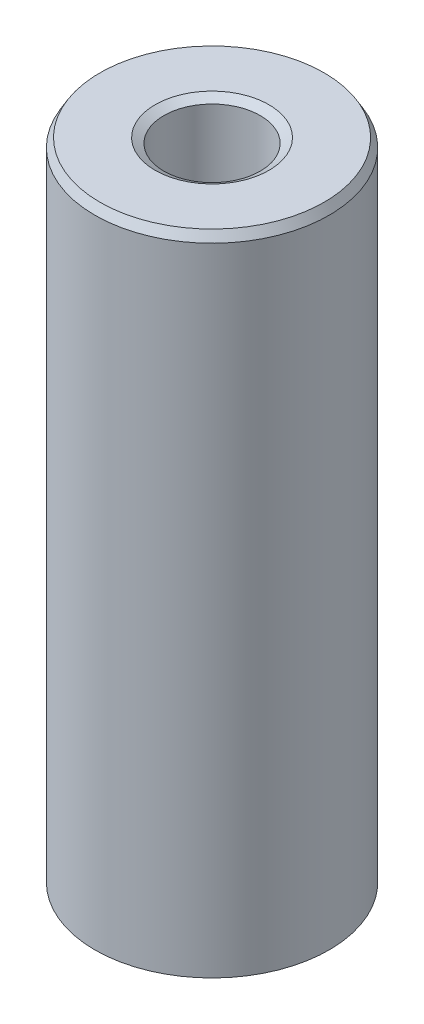
ISO-10303-21;
HEADER;
FILE_DESCRIPTION(('STEP AP214'),'2;1');
FILE_NAME('part.step','',(''),(''),'','','');
FILE_SCHEMA(('AUTOMOTIVE_DESIGN { 1 0 10303 214 1 1 1 1 }'));
ENDSEC;
DATA;
#1=APPLICATION_CONTEXT('core data for automotive mechanical design processes');
#2=APPLICATION_PROTOCOL_DEFINITION('international standard','automotive_design',2000,#1);
#3=PRODUCT_CONTEXT('',#1,'mechanical');
#4=PRODUCT('Part','Part','',(#3));
#5=PRODUCT_RELATED_PRODUCT_CATEGORY('part','',(#4));
#6=PRODUCT_DEFINITION_FORMATION('','',#4);
#7=PRODUCT_DEFINITION_CONTEXT('part definition',#1,'design');
#8=PRODUCT_DEFINITION('design','',#6,#7);
#9=PRODUCT_DEFINITION_SHAPE('','',#8);
#10=(LENGTH_UNIT() NAMED_UNIT(*) SI_UNIT(.MILLI.,.METRE.));
#11=(NAMED_UNIT(*) PLANE_ANGLE_UNIT() SI_UNIT($,.RADIAN.));
#12=(NAMED_UNIT(*) SI_UNIT($,.STERADIAN.) SOLID_ANGLE_UNIT());
#13=UNCERTAINTY_MEASURE_WITH_UNIT(LENGTH_MEASURE(1.E-05),#10,'distance_accuracy_value','');
#14=(GEOMETRIC_REPRESENTATION_CONTEXT(3) GLOBAL_UNCERTAINTY_ASSIGNED_CONTEXT((#13)) GLOBAL_UNIT_ASSIGNED_CONTEXT((#10,
#11,#12)) REPRESENTATION_CONTEXT('',''));
#15=CARTESIAN_POINT('',(0.,0.,0.));
#16=DIRECTION('',(0.,0.,1.));
#17=DIRECTION('',(1.,0.,0.));
#18=AXIS2_PLACEMENT_3D('',#15,#16,#17);
#19=CARTESIAN_POINT('',(0.,291.279777192008,0.));
#20=DIRECTION('',(0.,-1.,0.));
#21=DIRECTION('',(0.,0.,-1.));
#22=AXIS2_PLACEMENT_3D('',#19,#20,#21);
#23=CYLINDRICAL_SURFACE('',#22,52.5);
#24=CARTESIAN_POINT('',(0.,2.25674227579525,0.));
#25=DIRECTION('',(0.,1.,0.));
#26=DIRECTION('',(0.,0.,1.));
#27=AXIS2_PLACEMENT_3D('',#24,#25,#26);
#28=CIRCLE('',#27,52.5);
#29=CARTESIAN_POINT('',(0.,2.25674227579525,52.5));
#30=VERTEX_POINT('',#29);
#31=EDGE_CURVE('E10',#30,#30,#28,.T.);
#32=ORIENTED_EDGE('',*,*,#31,.T.);
#33=EDGE_LOOP('',(#32));
#34=FACE_BOUND('',#33,.T.);
#35=CARTESIAN_POINT('',(0.,287.370984910742,0.));
#36=DIRECTION('',(0.,1.,0.));
#37=DIRECTION('',(0.,0.,1.));
#38=AXIS2_PLACEMENT_3D('',#35,#36,#37);
#39=CIRCLE('',#38,52.5);
#40=CARTESIAN_POINT('',(0.,287.370984910742,52.5));
#41=VERTEX_POINT('',#40);
#42=EDGE_CURVE('E50',#41,#41,#39,.F.);
#43=ORIENTED_EDGE('',*,*,#42,.T.);
#44=EDGE_LOOP('',(#43));
#45=FACE_BOUND('',#44,.T.);
#46=ADVANCED_FACE('F39',(#34,#45),#23,.T.);
#47=CARTESIAN_POINT('',(0.,291.279777192008,0.));
#48=DIRECTION('',(0.,1.,0.));
#49=DIRECTION('',(0.,0.,1.));
#50=AXIS2_PLACEMENT_3D('',#47,#48,#49);
#51=PLANE('',#50);
#52=CARTESIAN_POINT('',(0.,291.279777192008,0.));
#53=DIRECTION('',(0.,1.,0.));
#54=DIRECTION('',(0.,0.,1.));
#55=AXIS2_PLACEMENT_3D('',#52,#53,#54);
#56=CIRCLE('',#55,25.4974483863553);
#57=CARTESIAN_POINT('',(0.,291.279777192008,25.4974483863553));
#58=VERTEX_POINT('',#57);
#59=EDGE_CURVE('E58',#58,#58,#56,.F.);
#60=ORIENTED_EDGE('',*,*,#59,.T.);
#61=EDGE_LOOP('',(#60));
#62=FACE_BOUND('',#61,.T.);
#63=CARTESIAN_POINT('',(0.,291.279777192008,0.));
#64=DIRECTION('',(0.,1.,0.));
#65=DIRECTION('',(0.,0.,1.));
#66=AXIS2_PLACEMENT_3D('',#63,#64,#65);
#67=CIRCLE('',#66,50.2432577242047);
#68=CARTESIAN_POINT('',(0.,291.279777192008,50.2432577242047));
#69=VERTEX_POINT('',#68);
#70=EDGE_CURVE('E61',#69,#69,#67,.T.);
#71=ORIENTED_EDGE('',*,*,#70,.T.);
#72=EDGE_LOOP('',(#71));
#73=FACE_BOUND('',#72,.T.);
#74=ADVANCED_FACE('F88',(#62,#73),#51,.T.);
#75=CARTESIAN_POINT('',(0.,0.,0.));
#76=DIRECTION('',(0.,1.,0.));
#77=DIRECTION('',(0.,0.,1.));
#78=AXIS2_PLACEMENT_3D('',#75,#76,#77);
#79=PLANE('',#78);
#80=CARTESIAN_POINT('',(0.,0.,0.));
#81=DIRECTION('',(0.,1.,0.));
#82=DIRECTION('',(0.,0.,1.));
#83=AXIS2_PLACEMENT_3D('',#80,#81,#82);
#84=CIRCLE('',#83,23.8453983808846);
#85=CARTESIAN_POINT('',(0.,0.,23.8453983808846));
#86=VERTEX_POINT('',#85);
#87=EDGE_CURVE('E51',#86,#86,#84,.T.);
#88=ORIENTED_EDGE('',*,*,#87,.T.);
#89=EDGE_LOOP('',(#88));
#90=FACE_BOUND('',#89,.T.);
#91=CARTESIAN_POINT('',(0.,0.,0.));
#92=DIRECTION('',(0.,1.,0.));
#93=DIRECTION('',(0.,0.,1.));
#94=AXIS2_PLACEMENT_3D('',#91,#92,#93);
#95=CIRCLE('',#94,48.591207718734);
#96=CARTESIAN_POINT('',(0.,0.,48.591207718734));
#97=VERTEX_POINT('',#96);
#98=EDGE_CURVE('E54',#97,#97,#95,.F.);
#99=ORIENTED_EDGE('',*,*,#98,.T.);
#100=EDGE_LOOP('',(#99));
#101=FACE_BOUND('',#100,.T.);
#102=ADVANCED_FACE('F83',(#90,#101),#79,.F.);
#103=CARTESIAN_POINT('',(0.,291.279777192008,0.));
#104=DIRECTION('',(0.,-1.,0.));
#105=DIRECTION('',(0.,0.,-1.));
#106=AXIS2_PLACEMENT_3D('',#103,#104,#105);
#107=CYLINDRICAL_SURFACE('',#106,21.5886561050892);
#108=CARTESIAN_POINT('',(0.,289.023034916213,0.));
#109=DIRECTION('',(0.,1.,0.));
#110=DIRECTION('',(0.,0.,1.));
#111=AXIS2_PLACEMENT_3D('',#108,#109,#110);
#112=CIRCLE('',#111,21.5886561050892);
#113=CARTESIAN_POINT('',(0.,289.023034916213,21.5886561050892));
#114=VERTEX_POINT('',#113);
#115=EDGE_CURVE('E67',#114,#114,#112,.T.);
#116=ORIENTED_EDGE('',*,*,#115,.T.);
#117=EDGE_LOOP('',(#116));
#118=FACE_BOUND('',#117,.T.);
#119=CARTESIAN_POINT('',(0.,3.90879228126612,0.));
#120=DIRECTION('',(0.,1.,0.));
#121=DIRECTION('',(0.,0.,1.));
#122=AXIS2_PLACEMENT_3D('',#119,#120,#121);
#123=CIRCLE('',#122,21.5886561050892);
#124=CARTESIAN_POINT('',(0.,3.90879228126612,21.5886561050892));
#125=VERTEX_POINT('',#124);
#126=EDGE_CURVE('E69',#125,#125,#123,.F.);
#127=ORIENTED_EDGE('',*,*,#126,.T.);
#128=EDGE_LOOP('',(#127));
#129=FACE_BOUND('',#128,.T.);
#130=ADVANCED_FACE('F71',(#118,#129),#107,.F.);
#131=CARTESIAN_POINT('',(0.,289.023034916213,0.));
#132=DIRECTION('',(0.,1.,0.));
#133=DIRECTION('',(0.,0.,1.));
#134=AXIS2_PLACEMENT_3D('',#131,#132,#133);
#135=CONICAL_SURFACE('',#134,21.5886561050892,1.04719755119661);
#136=ORIENTED_EDGE('',*,*,#59,.F.);
#137=EDGE_LOOP('',(#136));
#138=FACE_BOUND('',#137,.T.);
#139=ORIENTED_EDGE('',*,*,#115,.F.);
#140=EDGE_LOOP('',(#139));
#141=FACE_BOUND('',#140,.T.);
#142=ADVANCED_FACE('F77',(#138,#141),#135,.F.);
#143=CARTESIAN_POINT('',(0.,0.,0.));
#144=DIRECTION('',(0.,-1.,0.));
#145=DIRECTION('',(0.,0.,-1.));
#146=AXIS2_PLACEMENT_3D('',#143,#144,#145);
#147=CONICAL_SURFACE('',#146,23.8453983808846,0.523598775598298);
#148=ORIENTED_EDGE('',*,*,#126,.F.);
#149=EDGE_LOOP('',(#148));
#150=FACE_BOUND('',#149,.T.);
#151=ORIENTED_EDGE('',*,*,#87,.F.);
#152=EDGE_LOOP('',(#151));
#153=FACE_BOUND('',#152,.T.);
#154=ADVANCED_FACE('F73',(#150,#153),#147,.F.);
#155=CARTESIAN_POINT('',(0.,2.25674227579525,0.));
#156=DIRECTION('',(0.,1.,0.));
#157=DIRECTION('',(0.,0.,1.));
#158=AXIS2_PLACEMENT_3D('',#155,#156,#157);
#159=CONICAL_SURFACE('',#158,52.5,1.0471975511966);
#160=ORIENTED_EDGE('',*,*,#98,.F.);
#161=EDGE_LOOP('',(#160));
#162=FACE_BOUND('',#161,.T.);
#163=ORIENTED_EDGE('',*,*,#31,.F.);
#164=EDGE_LOOP('',(#163));
#165=FACE_BOUND('',#164,.T.);
#166=ADVANCED_FACE('F76',(#162,#165),#159,.T.);
#167=CARTESIAN_POINT('',(0.,291.279777192008,0.));
#168=DIRECTION('',(0.,-1.,0.));
#169=DIRECTION('',(0.,0.,-1.));
#170=AXIS2_PLACEMENT_3D('',#167,#168,#169);
#171=CONICAL_SURFACE('',#170,50.2432577242047,0.52359877559829);
#172=ORIENTED_EDGE('',*,*,#42,.F.);
#173=EDGE_LOOP('',(#172));
#174=FACE_BOUND('',#173,.T.);
#175=ORIENTED_EDGE('',*,*,#70,.F.);
#176=EDGE_LOOP('',(#175));
#177=FACE_BOUND('',#176,.T.);
#178=ADVANCED_FACE('F45',(#174,#177),#171,.T.);
#179=CLOSED_SHELL('',(#46,#74,#102,#130,#142,#154,#166,#178));
#180=MANIFOLD_SOLID_BREP('B2',#179);
#181=ADVANCED_BREP_SHAPE_REPRESENTATION('',(#18,#180),#14);
#182=SHAPE_DEFINITION_REPRESENTATION(#9,#181);
ENDSEC;
END-ISO-10303-21;
